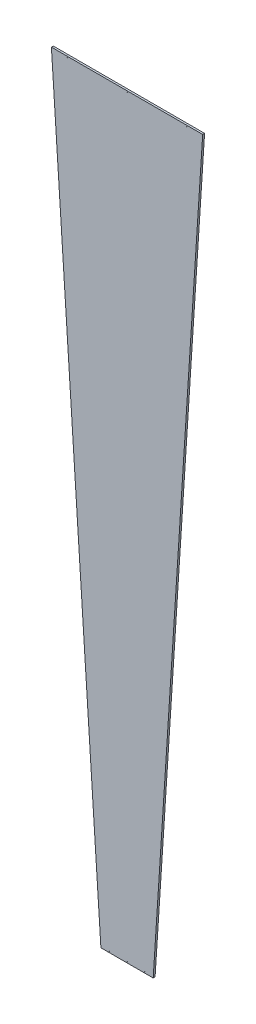
ISO-10303-21;
HEADER;
FILE_DESCRIPTION(('STEP AP214'),'2;1');
FILE_NAME('part.step','',(''),(''),'','','');
FILE_SCHEMA(('AUTOMOTIVE_DESIGN { 1 0 10303 214 1 1 1 1 }'));
ENDSEC;
DATA;
#1=APPLICATION_CONTEXT('core data for automotive mechanical design processes');
#2=APPLICATION_PROTOCOL_DEFINITION('international standard','automotive_design',2000,#1);
#3=PRODUCT_CONTEXT('',#1,'mechanical');
#4=PRODUCT('Part','Part','',(#3));
#5=PRODUCT_RELATED_PRODUCT_CATEGORY('part','',(#4));
#6=PRODUCT_DEFINITION_FORMATION('','',#4);
#7=PRODUCT_DEFINITION_CONTEXT('part definition',#1,'design');
#8=PRODUCT_DEFINITION('design','',#6,#7);
#9=PRODUCT_DEFINITION_SHAPE('','',#8);
#10=(LENGTH_UNIT() NAMED_UNIT(*) SI_UNIT(.MILLI.,.METRE.));
#11=(NAMED_UNIT(*) PLANE_ANGLE_UNIT() SI_UNIT($,.RADIAN.));
#12=(NAMED_UNIT(*) SI_UNIT($,.STERADIAN.) SOLID_ANGLE_UNIT());
#13=UNCERTAINTY_MEASURE_WITH_UNIT(LENGTH_MEASURE(1.E-05),#10,'distance_accuracy_value','');
#14=(GEOMETRIC_REPRESENTATION_CONTEXT(3) GLOBAL_UNCERTAINTY_ASSIGNED_CONTEXT((#13)) GLOBAL_UNIT_ASSIGNED_CONTEXT((#10,
#11,#12)) REPRESENTATION_CONTEXT('',''));
#15=CARTESIAN_POINT('',(0.,0.,0.));
#16=DIRECTION('',(0.,0.,1.));
#17=DIRECTION('',(1.,0.,0.));
#18=AXIS2_PLACEMENT_3D('',#15,#16,#17);
#19=CARTESIAN_POINT('',(-12.697,170.784102837897,0.16));
#20=DIRECTION('',(-0.997858923238604,-0.06540312923014,0.));
#21=DIRECTION('',(0.06540312923014,-0.997858923238604,0.));
#22=AXIS2_PLACEMENT_3D('',#19,#20,#21);
#23=PLANE('',#22);
#24=DIRECTION('',(-0.06540312923014,0.997858923238604,0.));
#25=VECTOR('',#24,1.);
#26=CARTESIAN_POINT('',(-12.697,170.784102837897,-0.16));
#27=LINE('',#26,#25);
#28=CARTESIAN_POINT('',(-4.38700000000002,43.9980033084044,-0.16));
#29=VERTEX_POINT('',#28);
#30=CARTESIAN_POINT('',(-12.697,170.784102837897,-0.16));
#31=VERTEX_POINT('',#30);
#32=EDGE_CURVE('E97',#29,#31,#27,.T.);
#33=ORIENTED_EDGE('',*,*,#32,.F.);
#34=DIRECTION('',(0.,0.,-1.));
#35=VECTOR('',#34,1.);
#36=CARTESIAN_POINT('',(-4.38700000000002,43.9980033084044,0.16));
#37=LINE('',#36,#35);
#38=CARTESIAN_POINT('',(-4.38700000000002,43.9980033084044,0.16));
#39=VERTEX_POINT('',#38);
#40=EDGE_CURVE('E11',#39,#29,#37,.T.);
#41=ORIENTED_EDGE('',*,*,#40,.F.);
#42=DIRECTION('',(-0.06540312923014,0.997858923238604,0.));
#43=VECTOR('',#42,1.);
#44=CARTESIAN_POINT('',(-12.697,170.784102837897,0.16));
#45=LINE('',#44,#43);
#46=CARTESIAN_POINT('',(-12.697,170.784102837897,0.16));
#47=VERTEX_POINT('',#46);
#48=EDGE_CURVE('E90',#39,#47,#45,.T.);
#49=ORIENTED_EDGE('',*,*,#48,.T.);
#50=DIRECTION('',(0.,0.,-1.));
#51=VECTOR('',#50,1.);
#52=CARTESIAN_POINT('',(-12.697,170.784102837897,0.16));
#53=LINE('',#52,#51);
#54=EDGE_CURVE('E35',#47,#31,#53,.T.);
#55=ORIENTED_EDGE('',*,*,#54,.T.);
#56=EDGE_LOOP('',(#33,#41,#49,#55));
#57=FACE_BOUND('',#56,.T.);
#58=ADVANCED_FACE('F32',(#57),#23,.T.);
#59=CARTESIAN_POINT('',(4.38699999999998,43.9980033084044,0.16));
#60=DIRECTION('',(0.,-1.,0.));
#61=DIRECTION('',(0.,0.,-1.));
#62=AXIS2_PLACEMENT_3D('',#59,#60,#61);
#63=PLANE('',#62);
#64=DIRECTION('',(-1.,0.,0.));
#65=VECTOR('',#64,1.);
#66=CARTESIAN_POINT('',(4.38699999999998,43.9980033084044,-0.16));
#67=LINE('',#66,#65);
#68=CARTESIAN_POINT('',(4.38699999999998,43.9980033084044,-0.16));
#69=VERTEX_POINT('',#68);
#70=EDGE_CURVE('E92',#69,#29,#67,.T.);
#71=ORIENTED_EDGE('',*,*,#70,.F.);
#72=DIRECTION('',(0.,0.,-1.));
#73=VECTOR('',#72,1.);
#74=CARTESIAN_POINT('',(4.38699999999998,43.9980033084044,0.16));
#75=LINE('',#74,#73);
#76=CARTESIAN_POINT('',(4.38699999999998,43.9980033084044,0.16));
#77=VERTEX_POINT('',#76);
#78=EDGE_CURVE('E41',#77,#69,#75,.T.);
#79=ORIENTED_EDGE('',*,*,#78,.F.);
#80=DIRECTION('',(-1.,0.,0.));
#81=VECTOR('',#80,1.);
#82=CARTESIAN_POINT('',(4.38699999999998,43.9980033084044,0.16));
#83=LINE('',#82,#81);
#84=EDGE_CURVE('E87',#77,#39,#83,.T.);
#85=ORIENTED_EDGE('',*,*,#84,.T.);
#86=ORIENTED_EDGE('',*,*,#40,.T.);
#87=EDGE_LOOP('',(#71,#79,#85,#86));
#88=FACE_BOUND('',#87,.T.);
#89=ADVANCED_FACE('F108',(#88),#63,.T.);
#90=CARTESIAN_POINT('',(12.697,170.784102837897,0.16));
#91=DIRECTION('',(0.997858923238604,-0.0654031292301402,0.));
#92=DIRECTION('',(0.0654031292301402,0.997858923238604,0.));
#93=AXIS2_PLACEMENT_3D('',#90,#91,#92);
#94=PLANE('',#93);
#95=DIRECTION('',(-0.0654031292301402,-0.997858923238604,0.));
#96=VECTOR('',#95,1.);
#97=CARTESIAN_POINT('',(12.697,170.784102837897,-0.16));
#98=LINE('',#97,#96);
#99=CARTESIAN_POINT('',(12.697,170.784102837897,-0.16));
#100=VERTEX_POINT('',#99);
#101=EDGE_CURVE('E82',#100,#69,#98,.T.);
#102=ORIENTED_EDGE('',*,*,#101,.F.);
#103=DIRECTION('',(0.,0.,-1.));
#104=VECTOR('',#103,1.);
#105=CARTESIAN_POINT('',(12.697,170.784102837897,0.16));
#106=LINE('',#105,#104);
#107=CARTESIAN_POINT('',(12.697,170.784102837897,0.16));
#108=VERTEX_POINT('',#107);
#109=EDGE_CURVE('E77',#108,#100,#106,.T.);
#110=ORIENTED_EDGE('',*,*,#109,.F.);
#111=DIRECTION('',(-0.0654031292301402,-0.997858923238604,0.));
#112=VECTOR('',#111,1.);
#113=CARTESIAN_POINT('',(12.697,170.784102837897,0.16));
#114=LINE('',#113,#112);
#115=EDGE_CURVE('E80',#108,#77,#114,.T.);
#116=ORIENTED_EDGE('',*,*,#115,.T.);
#117=ORIENTED_EDGE('',*,*,#78,.T.);
#118=EDGE_LOOP('',(#102,#110,#116,#117));
#119=FACE_BOUND('',#118,.T.);
#120=ADVANCED_FACE('F79',(#119),#94,.T.);
#121=CARTESIAN_POINT('',(-12.697,170.784102837897,0.16));
#122=DIRECTION('',(0.,1.,0.));
#123=DIRECTION('',(0.,0.,1.));
#124=AXIS2_PLACEMENT_3D('',#121,#122,#123);
#125=PLANE('',#124);
#126=DIRECTION('',(1.,0.,0.));
#127=VECTOR('',#126,1.);
#128=CARTESIAN_POINT('',(-12.697,170.784102837897,-0.16));
#129=LINE('',#128,#127);
#130=EDGE_CURVE('E100',#31,#100,#129,.T.);
#131=ORIENTED_EDGE('',*,*,#130,.F.);
#132=ORIENTED_EDGE('',*,*,#54,.F.);
#133=DIRECTION('',(1.,0.,0.));
#134=VECTOR('',#133,1.);
#135=CARTESIAN_POINT('',(-12.697,170.784102837897,0.16));
#136=LINE('',#135,#134);
#137=EDGE_CURVE('E86',#47,#108,#136,.T.);
#138=ORIENTED_EDGE('',*,*,#137,.T.);
#139=ORIENTED_EDGE('',*,*,#109,.T.);
#140=EDGE_LOOP('',(#131,#132,#138,#139));
#141=FACE_BOUND('',#140,.T.);
#142=ADVANCED_FACE('F89',(#141),#125,.T.);
#143=CARTESIAN_POINT('',(-4.38700000000002,43.9980033084044,0.16));
#144=DIRECTION('',(0.,0.,-1.));
#145=DIRECTION('',(-1.,0.,0.));
#146=AXIS2_PLACEMENT_3D('',#143,#144,#145);
#147=PLANE('',#146);
#148=CARTESIAN_POINT('',(10.,170.583003308404,0.16));
#149=DIRECTION('',(0.,0.,1.));
#150=DIRECTION('',(-1.,0.,0.));
#151=AXIS2_PLACEMENT_3D('',#148,#149,#150);
#152=CIRCLE('',#151,0.0499999999999873);
#153=CARTESIAN_POINT('',(9.95000000000001,170.583003308404,0.16));
#154=VERTEX_POINT('',#153);
#155=EDGE_CURVE('E160',#154,#154,#152,.T.);
#156=ORIENTED_EDGE('',*,*,#155,.F.);
#157=EDGE_LOOP('',(#156));
#158=FACE_BOUND('',#157,.T.);
#159=CARTESIAN_POINT('',(-10.,170.583003308404,0.16));
#160=DIRECTION('',(0.,0.,1.));
#161=DIRECTION('',(1.,0.,0.));
#162=AXIS2_PLACEMENT_3D('',#159,#160,#161);
#163=CIRCLE('',#162,0.0499999999999907);
#164=CARTESIAN_POINT('',(-9.95000000000001,170.583003308404,0.16));
#165=VERTEX_POINT('',#164);
#166=EDGE_CURVE('E162',#165,#165,#163,.T.);
#167=ORIENTED_EDGE('',*,*,#166,.F.);
#168=EDGE_LOOP('',(#167));
#169=FACE_BOUND('',#168,.T.);
#170=CARTESIAN_POINT('',(0.,170.583003308404,0.16));
#171=DIRECTION('',(0.,0.,1.));
#172=DIRECTION('',(1.,0.,0.));
#173=AXIS2_PLACEMENT_3D('',#170,#171,#172);
#174=CIRCLE('',#173,0.0499999999999912);
#175=CARTESIAN_POINT('',(0.0499999999999912,170.583003308404,0.16));
#176=VERTEX_POINT('',#175);
#177=EDGE_CURVE('E168',#176,#176,#174,.T.);
#178=ORIENTED_EDGE('',*,*,#177,.F.);
#179=EDGE_LOOP('',(#178));
#180=FACE_BOUND('',#179,.T.);
#181=CARTESIAN_POINT('',(3.,44.1980033084044,0.16));
#182=DIRECTION('',(0.,0.,1.));
#183=DIRECTION('',(-1.,0.,0.));
#184=AXIS2_PLACEMENT_3D('',#181,#182,#183);
#185=CIRCLE('',#184,0.050000000000001);
#186=CARTESIAN_POINT('',(2.95,44.1980033084044,0.16));
#187=VERTEX_POINT('',#186);
#188=EDGE_CURVE('E174',#187,#187,#185,.T.);
#189=ORIENTED_EDGE('',*,*,#188,.F.);
#190=EDGE_LOOP('',(#189));
#191=FACE_BOUND('',#190,.T.);
#192=CARTESIAN_POINT('',(0.,44.1980033084044,0.16));
#193=DIRECTION('',(0.,0.,1.));
#194=DIRECTION('',(1.,0.,0.));
#195=AXIS2_PLACEMENT_3D('',#192,#193,#194);
#196=CIRCLE('',#195,0.0500000000000008);
#197=CARTESIAN_POINT('',(0.0500000000000008,44.1980033084044,0.16));
#198=VERTEX_POINT('',#197);
#199=EDGE_CURVE('E180',#198,#198,#196,.T.);
#200=ORIENTED_EDGE('',*,*,#199,.F.);
#201=EDGE_LOOP('',(#200));
#202=FACE_BOUND('',#201,.T.);
#203=CARTESIAN_POINT('',(-3.,44.1980033084044,0.16));
#204=DIRECTION('',(0.,0.,1.));
#205=DIRECTION('',(1.,0.,0.));
#206=AXIS2_PLACEMENT_3D('',#203,#204,#205);
#207=CIRCLE('',#206,0.050000000000001);
#208=CARTESIAN_POINT('',(-2.95,44.1980033084044,0.16));
#209=VERTEX_POINT('',#208);
#210=EDGE_CURVE('E186',#209,#209,#207,.T.);
#211=ORIENTED_EDGE('',*,*,#210,.F.);
#212=EDGE_LOOP('',(#211));
#213=FACE_BOUND('',#212,.T.);
#214=ORIENTED_EDGE('',*,*,#48,.F.);
#215=ORIENTED_EDGE('',*,*,#84,.F.);
#216=ORIENTED_EDGE('',*,*,#115,.F.);
#217=ORIENTED_EDGE('',*,*,#137,.F.);
#218=EDGE_LOOP('',(#214,#215,#216,#217));
#219=FACE_BOUND('',#218,.T.);
#220=ADVANCED_FACE('F85',(#158,#169,#180,#191,#202,#213,#219),#147,.F.);
#221=CARTESIAN_POINT('',(-4.38700000000002,43.9980033084044,-0.16));
#222=DIRECTION('',(0.,0.,-1.));
#223=DIRECTION('',(-1.,0.,0.));
#224=AXIS2_PLACEMENT_3D('',#221,#222,#223);
#225=PLANE('',#224);
#226=CARTESIAN_POINT('',(10.,170.583003308404,-0.16));
#227=DIRECTION('',(0.,0.,1.));
#228=DIRECTION('',(-1.,0.,0.));
#229=AXIS2_PLACEMENT_3D('',#226,#227,#228);
#230=CIRCLE('',#229,0.0499999999999873);
#231=CARTESIAN_POINT('',(9.95000000000001,170.583003308404,-0.16));
#232=VERTEX_POINT('',#231);
#233=EDGE_CURVE('E158',#232,#232,#230,.T.);
#234=ORIENTED_EDGE('',*,*,#233,.T.);
#235=EDGE_LOOP('',(#234));
#236=FACE_BOUND('',#235,.T.);
#237=CARTESIAN_POINT('',(-10.,170.583003308404,-0.16));
#238=DIRECTION('',(0.,0.,1.));
#239=DIRECTION('',(1.,0.,0.));
#240=AXIS2_PLACEMENT_3D('',#237,#238,#239);
#241=CIRCLE('',#240,0.0499999999999907);
#242=CARTESIAN_POINT('',(-9.95000000000001,170.583003308404,-0.16));
#243=VERTEX_POINT('',#242);
#244=EDGE_CURVE('E165',#243,#243,#241,.T.);
#245=ORIENTED_EDGE('',*,*,#244,.T.);
#246=EDGE_LOOP('',(#245));
#247=FACE_BOUND('',#246,.T.);
#248=CARTESIAN_POINT('',(0.,170.583003308404,-0.16));
#249=DIRECTION('',(0.,0.,1.));
#250=DIRECTION('',(1.,0.,0.));
#251=AXIS2_PLACEMENT_3D('',#248,#249,#250);
#252=CIRCLE('',#251,0.0499999999999912);
#253=CARTESIAN_POINT('',(0.0499999999999912,170.583003308404,-0.16));
#254=VERTEX_POINT('',#253);
#255=EDGE_CURVE('E171',#254,#254,#252,.T.);
#256=ORIENTED_EDGE('',*,*,#255,.T.);
#257=EDGE_LOOP('',(#256));
#258=FACE_BOUND('',#257,.T.);
#259=CARTESIAN_POINT('',(3.,44.1980033084044,-0.16));
#260=DIRECTION('',(0.,0.,1.));
#261=DIRECTION('',(-1.,0.,0.));
#262=AXIS2_PLACEMENT_3D('',#259,#260,#261);
#263=CIRCLE('',#262,0.050000000000001);
#264=CARTESIAN_POINT('',(2.95,44.1980033084044,-0.16));
#265=VERTEX_POINT('',#264);
#266=EDGE_CURVE('E177',#265,#265,#263,.T.);
#267=ORIENTED_EDGE('',*,*,#266,.T.);
#268=EDGE_LOOP('',(#267));
#269=FACE_BOUND('',#268,.T.);
#270=CARTESIAN_POINT('',(0.,44.1980033084044,-0.16));
#271=DIRECTION('',(0.,0.,1.));
#272=DIRECTION('',(1.,0.,0.));
#273=AXIS2_PLACEMENT_3D('',#270,#271,#272);
#274=CIRCLE('',#273,0.0500000000000008);
#275=CARTESIAN_POINT('',(0.0500000000000008,44.1980033084044,-0.16));
#276=VERTEX_POINT('',#275);
#277=EDGE_CURVE('E183',#276,#276,#274,.T.);
#278=ORIENTED_EDGE('',*,*,#277,.T.);
#279=EDGE_LOOP('',(#278));
#280=FACE_BOUND('',#279,.T.);
#281=CARTESIAN_POINT('',(-3.,44.1980033084044,-0.16));
#282=DIRECTION('',(0.,0.,1.));
#283=DIRECTION('',(1.,0.,0.));
#284=AXIS2_PLACEMENT_3D('',#281,#282,#283);
#285=CIRCLE('',#284,0.050000000000001);
#286=CARTESIAN_POINT('',(-2.95,44.1980033084044,-0.16));
#287=VERTEX_POINT('',#286);
#288=EDGE_CURVE('E101',#287,#287,#285,.T.);
#289=ORIENTED_EDGE('',*,*,#288,.T.);
#290=EDGE_LOOP('',(#289));
#291=FACE_BOUND('',#290,.T.);
#292=ORIENTED_EDGE('',*,*,#32,.T.);
#293=ORIENTED_EDGE('',*,*,#130,.T.);
#294=ORIENTED_EDGE('',*,*,#101,.T.);
#295=ORIENTED_EDGE('',*,*,#70,.T.);
#296=EDGE_LOOP('',(#292,#293,#294,#295));
#297=FACE_BOUND('',#296,.T.);
#298=ADVANCED_FACE('F107',(#236,#247,#258,#269,#280,#291,#297),#225,.T.);
#299=CARTESIAN_POINT('',(-3.,44.1980033084044,-0.16));
#300=DIRECTION('',(0.,0.,1.));
#301=DIRECTION('',(1.,0.,0.));
#302=AXIS2_PLACEMENT_3D('',#299,#300,#301);
#303=CYLINDRICAL_SURFACE('',#302,0.050000000000001);
#304=ORIENTED_EDGE('',*,*,#288,.F.);
#305=EDGE_LOOP('',(#304));
#306=FACE_BOUND('',#305,.T.);
#307=ORIENTED_EDGE('',*,*,#210,.T.);
#308=EDGE_LOOP('',(#307));
#309=FACE_BOUND('',#308,.T.);
#310=ADVANCED_FACE('F126',(#306,#309),#303,.F.);
#311=CARTESIAN_POINT('',(0.,44.1980033084044,-0.16));
#312=DIRECTION('',(0.,0.,1.));
#313=DIRECTION('',(1.,0.,0.));
#314=AXIS2_PLACEMENT_3D('',#311,#312,#313);
#315=CYLINDRICAL_SURFACE('',#314,0.0500000000000008);
#316=ORIENTED_EDGE('',*,*,#277,.F.);
#317=EDGE_LOOP('',(#316));
#318=FACE_BOUND('',#317,.T.);
#319=ORIENTED_EDGE('',*,*,#199,.T.);
#320=EDGE_LOOP('',(#319));
#321=FACE_BOUND('',#320,.T.);
#322=ADVANCED_FACE('F133',(#318,#321),#315,.F.);
#323=CARTESIAN_POINT('',(3.,44.1980033084044,-0.16));
#324=DIRECTION('',(0.,0.,1.));
#325=DIRECTION('',(1.,0.,0.));
#326=AXIS2_PLACEMENT_3D('',#323,#324,#325);
#327=CYLINDRICAL_SURFACE('',#326,0.050000000000001);
#328=ORIENTED_EDGE('',*,*,#266,.F.);
#329=EDGE_LOOP('',(#328));
#330=FACE_BOUND('',#329,.T.);
#331=ORIENTED_EDGE('',*,*,#188,.T.);
#332=EDGE_LOOP('',(#331));
#333=FACE_BOUND('',#332,.T.);
#334=ADVANCED_FACE('F137',(#330,#333),#327,.F.);
#335=CARTESIAN_POINT('',(0.,170.583003308404,-0.16));
#336=DIRECTION('',(0.,0.,1.));
#337=DIRECTION('',(1.,0.,0.));
#338=AXIS2_PLACEMENT_3D('',#335,#336,#337);
#339=CYLINDRICAL_SURFACE('',#338,0.0499999999999912);
#340=ORIENTED_EDGE('',*,*,#255,.F.);
#341=EDGE_LOOP('',(#340));
#342=FACE_BOUND('',#341,.T.);
#343=ORIENTED_EDGE('',*,*,#177,.T.);
#344=EDGE_LOOP('',(#343));
#345=FACE_BOUND('',#344,.T.);
#346=ADVANCED_FACE('F141',(#342,#345),#339,.F.);
#347=CARTESIAN_POINT('',(-10.,170.583003308404,-0.16));
#348=DIRECTION('',(0.,0.,1.));
#349=DIRECTION('',(1.,0.,0.));
#350=AXIS2_PLACEMENT_3D('',#347,#348,#349);
#351=CYLINDRICAL_SURFACE('',#350,0.0499999999999907);
#352=ORIENTED_EDGE('',*,*,#244,.F.);
#353=EDGE_LOOP('',(#352));
#354=FACE_BOUND('',#353,.T.);
#355=ORIENTED_EDGE('',*,*,#166,.T.);
#356=EDGE_LOOP('',(#355));
#357=FACE_BOUND('',#356,.T.);
#358=ADVANCED_FACE('F145',(#354,#357),#351,.F.);
#359=CARTESIAN_POINT('',(10.,170.583003308404,-0.16));
#360=DIRECTION('',(0.,0.,1.));
#361=DIRECTION('',(1.,0.,0.));
#362=AXIS2_PLACEMENT_3D('',#359,#360,#361);
#363=CYLINDRICAL_SURFACE('',#362,0.0499999999999873);
#364=ORIENTED_EDGE('',*,*,#233,.F.);
#365=EDGE_LOOP('',(#364));
#366=FACE_BOUND('',#365,.T.);
#367=ORIENTED_EDGE('',*,*,#155,.T.);
#368=EDGE_LOOP('',(#367));
#369=FACE_BOUND('',#368,.T.);
#370=ADVANCED_FACE('F149',(#366,#369),#363,.F.);
#371=CLOSED_SHELL('',(#58,#89,#120,#142,#220,#298,#310,#322,#334,#346,#358,#370));
#372=MANIFOLD_SOLID_BREP('B2',#371);
#373=ADVANCED_BREP_SHAPE_REPRESENTATION('',(#18,#372),#14);
#374=SHAPE_DEFINITION_REPRESENTATION(#9,#373);
ENDSEC;
END-ISO-10303-21;
